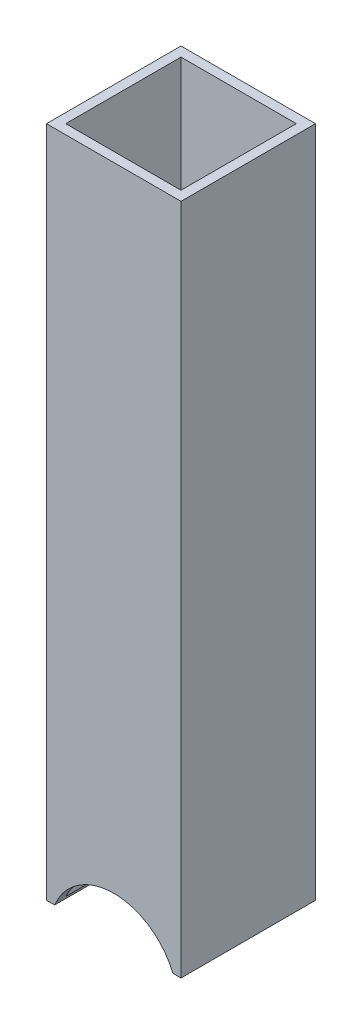
ISO-10303-21;
HEADER;
FILE_DESCRIPTION(('STEP AP214'),'2;1');
FILE_NAME('part.step','',(''),(''),'','','');
FILE_SCHEMA(('AUTOMOTIVE_DESIGN { 1 0 10303 214 1 1 1 1 }'));
ENDSEC;
DATA;
#1=APPLICATION_CONTEXT('core data for automotive mechanical design processes');
#2=APPLICATION_PROTOCOL_DEFINITION('international standard','automotive_design',2000,#1);
#3=PRODUCT_CONTEXT('',#1,'mechanical');
#4=PRODUCT('Part','Part','',(#3));
#5=PRODUCT_RELATED_PRODUCT_CATEGORY('part','',(#4));
#6=PRODUCT_DEFINITION_FORMATION('','',#4);
#7=PRODUCT_DEFINITION_CONTEXT('part definition',#1,'design');
#8=PRODUCT_DEFINITION('design','',#6,#7);
#9=PRODUCT_DEFINITION_SHAPE('','',#8);
#10=(LENGTH_UNIT() NAMED_UNIT(*) SI_UNIT(.MILLI.,.METRE.));
#11=(NAMED_UNIT(*) PLANE_ANGLE_UNIT() SI_UNIT($,.RADIAN.));
#12=(NAMED_UNIT(*) SI_UNIT($,.STERADIAN.) SOLID_ANGLE_UNIT());
#13=UNCERTAINTY_MEASURE_WITH_UNIT(LENGTH_MEASURE(1.E-05),#10,'distance_accuracy_value','');
#14=(GEOMETRIC_REPRESENTATION_CONTEXT(3) GLOBAL_UNCERTAINTY_ASSIGNED_CONTEXT((#13)) GLOBAL_UNIT_ASSIGNED_CONTEXT((#10,
#11,#12)) REPRESENTATION_CONTEXT('',''));
#15=CARTESIAN_POINT('',(0.,0.,0.));
#16=DIRECTION('',(0.,0.,1.));
#17=DIRECTION('',(1.,0.,0.));
#18=AXIS2_PLACEMENT_3D('',#15,#16,#17);
#19=CARTESIAN_POINT('',(0.,-127.,1.33226762955019E-12));
#20=DIRECTION('',(0.,-1.,0.));
#21=DIRECTION('',(0.,0.,-1.));
#22=AXIS2_PLACEMENT_3D('',#19,#20,#21);
#23=PLANE('',#22);
#24=DIRECTION('',(0.,0.,1.));
#25=VECTOR('',#24,1.);
#26=CARTESIAN_POINT('',(19.5306635255947,-127.,-22.2249999999973));
#27=LINE('',#26,#25);
#28=CARTESIAN_POINT('',(19.5306635255947,-127.,-22.2249999999973));
#29=VERTEX_POINT('',#28);
#30=CARTESIAN_POINT('',(19.5306635255948,-127.,22.2250000000013));
#31=VERTEX_POINT('',#30);
#32=EDGE_CURVE('E11',#29,#31,#27,.T.);
#33=ORIENTED_EDGE('',*,*,#32,.F.);
#34=DIRECTION('',(0.999999999999995,0.,0.));
#35=VECTOR('',#34,1.);
#36=CARTESIAN_POINT('',(-22.2249999999998,-127.,-22.2249999999973));
#37=LINE('',#36,#35);
#38=CARTESIAN_POINT('',(22.2249999999998,-127.,-22.2249999999973));
#39=VERTEX_POINT('',#38);
#40=EDGE_CURVE('E211',#29,#39,#37,.T.);
#41=ORIENTED_EDGE('',*,*,#40,.T.);
#42=DIRECTION('',(0.,0.,1.));
#43=VECTOR('',#42,1.);
#44=CARTESIAN_POINT('',(22.2249999999998,-127.,-22.2249999999973));
#45=LINE('',#44,#43);
#46=CARTESIAN_POINT('',(22.225,-127.,22.2250000000013));
#47=VERTEX_POINT('',#46);
#48=EDGE_CURVE('E135',#39,#47,#45,.T.);
#49=ORIENTED_EDGE('',*,*,#48,.T.);
#50=DIRECTION('',(-0.999999999999995,0.,0.));
#51=VECTOR('',#50,1.);
#52=CARTESIAN_POINT('',(22.225,-127.,22.2250000000013));
#53=LINE('',#52,#51);
#54=EDGE_CURVE('E128',#47,#31,#53,.T.);
#55=ORIENTED_EDGE('',*,*,#54,.T.);
#56=EDGE_LOOP('',(#33,#41,#49,#55));
#57=FACE_BOUND('',#56,.T.);
#58=ADVANCED_FACE('F43',(#57),#23,.T.);
#59=CARTESIAN_POINT('',(22.225,-95.25,22.2250000000013));
#60=DIRECTION('',(0.999999999999995,0.,0.));
#61=DIRECTION('',(0.,0.,-1.));
#62=AXIS2_PLACEMENT_3D('',#59,#60,#61);
#63=PLANE('',#62);
#64=DIRECTION('',(0.,1.,0.));
#65=VECTOR('',#64,1.);
#66=CARTESIAN_POINT('',(22.2249999999998,-95.25,-22.225));
#67=LINE('',#66,#65);
#68=CARTESIAN_POINT('',(22.2249999999998,95.2499999999987,-22.225));
#69=VERTEX_POINT('',#68);
#70=EDGE_CURVE('E183',#39,#69,#67,.T.);
#71=ORIENTED_EDGE('',*,*,#70,.T.);
#72=DIRECTION('',(0.,0.,-1.));
#73=VECTOR('',#72,1.);
#74=CARTESIAN_POINT('',(22.225,95.25,22.225));
#75=LINE('',#74,#73);
#76=CARTESIAN_POINT('',(22.225,95.25,22.225));
#77=VERTEX_POINT('',#76);
#78=EDGE_CURVE('E163',#77,#69,#75,.T.);
#79=ORIENTED_EDGE('',*,*,#78,.F.);
#80=DIRECTION('',(0.,1.,0.));
#81=VECTOR('',#80,1.);
#82=CARTESIAN_POINT('',(22.225,-95.25,22.2250000000013));
#83=LINE('',#82,#81);
#84=EDGE_CURVE('E192',#47,#77,#83,.T.);
#85=ORIENTED_EDGE('',*,*,#84,.F.);
#86=ORIENTED_EDGE('',*,*,#48,.F.);
#87=EDGE_LOOP('',(#71,#79,#85,#86));
#88=FACE_BOUND('',#87,.T.);
#89=ADVANCED_FACE('F45',(#88),#63,.T.);
#90=CARTESIAN_POINT('',(-22.2249999999997,-95.25,22.2250000000013));
#91=DIRECTION('',(0.,0.,1.));
#92=DIRECTION('',(0.999999999999995,0.,0.));
#93=AXIS2_PLACEMENT_3D('',#90,#91,#92);
#94=PLANE('',#93);
#95=CARTESIAN_POINT('',(0.,-134.9375,22.2250000000013));
#96=DIRECTION('',(0.,0.,1.));
#97=DIRECTION('',(0.999999999999995,0.,0.));
#98=AXIS2_PLACEMENT_3D('',#95,#96,#97);
#99=CIRCLE('',#98,21.082);
#100=CARTESIAN_POINT('',(-19.5306635255945,-127.,22.2250000000013));
#101=VERTEX_POINT('',#100);
#102=EDGE_CURVE('E66',#31,#101,#99,.T.);
#103=ORIENTED_EDGE('',*,*,#102,.F.);
#104=ORIENTED_EDGE('',*,*,#54,.F.);
#105=ORIENTED_EDGE('',*,*,#84,.T.);
#106=DIRECTION('',(0.999999999999995,0.,0.));
#107=VECTOR('',#106,1.);
#108=CARTESIAN_POINT('',(-22.2249999999997,95.25,22.225));
#109=LINE('',#108,#107);
#110=CARTESIAN_POINT('',(-22.2249999999997,95.25,22.225));
#111=VERTEX_POINT('',#110);
#112=EDGE_CURVE('E175',#111,#77,#109,.T.);
#113=ORIENTED_EDGE('',*,*,#112,.F.);
#114=DIRECTION('',(0.,1.,0.));
#115=VECTOR('',#114,1.);
#116=CARTESIAN_POINT('',(-22.2249999999997,-95.25,22.2250000000013));
#117=LINE('',#116,#115);
#118=CARTESIAN_POINT('',(-22.2249999999997,-127.,22.2250000000013));
#119=VERTEX_POINT('',#118);
#120=EDGE_CURVE('E195',#119,#111,#117,.T.);
#121=ORIENTED_EDGE('',*,*,#120,.F.);
#122=EDGE_CURVE('E130',#101,#119,#53,.T.);
#123=ORIENTED_EDGE('',*,*,#122,.F.);
#124=EDGE_LOOP('',(#103,#104,#105,#113,#121,#123));
#125=FACE_BOUND('',#124,.T.);
#126=ADVANCED_FACE('F127',(#125),#94,.T.);
#127=CARTESIAN_POINT('',(-22.2249999999997,-95.25,22.2250000000013));
#128=DIRECTION('',(-0.999999999999995,0.,0.));
#129=DIRECTION('',(0.,0.,1.));
#130=AXIS2_PLACEMENT_3D('',#127,#128,#129);
#131=PLANE('',#130);
#132=ORIENTED_EDGE('',*,*,#120,.T.);
#133=DIRECTION('',(0.,0.,1.));
#134=VECTOR('',#133,1.);
#135=CARTESIAN_POINT('',(-22.2249999999997,95.25,22.225));
#136=LINE('',#135,#134);
#137=CARTESIAN_POINT('',(-22.2249999999998,95.2499999999987,-22.225));
#138=VERTEX_POINT('',#137);
#139=EDGE_CURVE('E171',#138,#111,#136,.T.);
#140=ORIENTED_EDGE('',*,*,#139,.F.);
#141=DIRECTION('',(0.,1.,0.));
#142=VECTOR('',#141,1.);
#143=CARTESIAN_POINT('',(-22.2249999999998,-95.25,-22.225));
#144=LINE('',#143,#142);
#145=CARTESIAN_POINT('',(-22.2249999999998,-127.,-22.2249999999973));
#146=VERTEX_POINT('',#145);
#147=EDGE_CURVE('E198',#146,#138,#144,.T.);
#148=ORIENTED_EDGE('',*,*,#147,.F.);
#149=DIRECTION('',(0.,0.,-1.));
#150=VECTOR('',#149,1.);
#151=CARTESIAN_POINT('',(-22.2249999999997,-127.,22.2250000000013));
#152=LINE('',#151,#150);
#153=EDGE_CURVE('E137',#119,#146,#152,.T.);
#154=ORIENTED_EDGE('',*,*,#153,.F.);
#155=EDGE_LOOP('',(#132,#140,#148,#154));
#156=FACE_BOUND('',#155,.T.);
#157=ADVANCED_FACE('F283',(#156),#131,.T.);
#158=CARTESIAN_POINT('',(-22.2249999999998,-95.25,-22.225));
#159=DIRECTION('',(0.,0.,-1.));
#160=DIRECTION('',(-0.999999999999995,0.,0.));
#161=AXIS2_PLACEMENT_3D('',#158,#159,#160);
#162=PLANE('',#161);
#163=CARTESIAN_POINT('',(0.,-134.9375,-22.2249999999973));
#164=DIRECTION('',(0.,0.,1.));
#165=DIRECTION('',(0.999999999999995,0.,0.));
#166=AXIS2_PLACEMENT_3D('',#163,#164,#165);
#167=CIRCLE('',#166,21.082);
#168=CARTESIAN_POINT('',(-19.5306635255947,-127.,-22.2249999999973));
#169=VERTEX_POINT('',#168);
#170=EDGE_CURVE('E120',#29,#169,#167,.T.);
#171=ORIENTED_EDGE('',*,*,#170,.T.);
#172=EDGE_CURVE('E209',#146,#169,#37,.T.);
#173=ORIENTED_EDGE('',*,*,#172,.F.);
#174=ORIENTED_EDGE('',*,*,#147,.T.);
#175=DIRECTION('',(-0.999999999999995,0.,0.));
#176=VECTOR('',#175,1.);
#177=CARTESIAN_POINT('',(-22.2249999999998,95.2499999999987,-22.225));
#178=LINE('',#177,#176);
#179=EDGE_CURVE('E167',#69,#138,#178,.T.);
#180=ORIENTED_EDGE('',*,*,#179,.F.);
#181=ORIENTED_EDGE('',*,*,#70,.F.);
#182=ORIENTED_EDGE('',*,*,#40,.F.);
#183=EDGE_LOOP('',(#171,#173,#174,#180,#181,#182));
#184=FACE_BOUND('',#183,.T.);
#185=ADVANCED_FACE('F208',(#184),#162,.T.);
#186=CARTESIAN_POINT('',(19.05,-95.25,19.0500000000013));
#187=DIRECTION('',(0.999999999999995,0.,0.));
#188=DIRECTION('',(0.,0.,-1.));
#189=AXIS2_PLACEMENT_3D('',#186,#187,#188);
#190=PLANE('',#189);
#191=DIRECTION('',(0.,1.,0.));
#192=VECTOR('',#191,1.);
#193=CARTESIAN_POINT('',(19.0499999999998,-95.25,-19.0500000000001));
#194=LINE('',#193,#192);
#195=CARTESIAN_POINT('',(19.0499999999998,-125.907094472007,-19.0499999999974));
#196=VERTEX_POINT('',#195);
#197=CARTESIAN_POINT('',(19.0499999999998,95.2499999999987,-19.05));
#198=VERTEX_POINT('',#197);
#199=EDGE_CURVE('E179',#196,#198,#194,.T.);
#200=ORIENTED_EDGE('',*,*,#199,.F.);
#201=DIRECTION('',(0.,0.,1.));
#202=VECTOR('',#201,1.);
#203=CARTESIAN_POINT('',(19.0499999999998,-125.907094472007,-22.2249999999973));
#204=LINE('',#203,#202);
#205=CARTESIAN_POINT('',(19.05,-125.907094472007,19.0500000000013));
#206=VERTEX_POINT('',#205);
#207=EDGE_CURVE('E59',#196,#206,#204,.T.);
#208=ORIENTED_EDGE('',*,*,#207,.T.);
#209=DIRECTION('',(0.,1.,0.));
#210=VECTOR('',#209,1.);
#211=CARTESIAN_POINT('',(19.05,-95.25,19.0500000000013));
#212=LINE('',#211,#210);
#213=CARTESIAN_POINT('',(19.05,95.25,19.05));
#214=VERTEX_POINT('',#213);
#215=EDGE_CURVE('E180',#206,#214,#212,.T.);
#216=ORIENTED_EDGE('',*,*,#215,.T.);
#217=DIRECTION('',(0.,0.,-1.));
#218=VECTOR('',#217,1.);
#219=CARTESIAN_POINT('',(19.05,95.25,19.05));
#220=LINE('',#219,#218);
#221=EDGE_CURVE('E143',#214,#198,#220,.T.);
#222=ORIENTED_EDGE('',*,*,#221,.T.);
#223=EDGE_LOOP('',(#200,#208,#216,#222));
#224=FACE_BOUND('',#223,.T.);
#225=ADVANCED_FACE('F239',(#224),#190,.F.);
#226=CARTESIAN_POINT('',(-19.0499999999997,-95.25,19.0500000000013));
#227=DIRECTION('',(0.,0.,1.));
#228=DIRECTION('',(0.999999999999995,0.,0.));
#229=AXIS2_PLACEMENT_3D('',#226,#227,#228);
#230=PLANE('',#229);
#231=ORIENTED_EDGE('',*,*,#215,.F.);
#232=CARTESIAN_POINT('',(0.,-134.9375,19.0500000000013));
#233=DIRECTION('',(0.,0.,1.));
#234=DIRECTION('',(0.999999999999995,0.,0.));
#235=AXIS2_PLACEMENT_3D('',#232,#233,#234);
#236=CIRCLE('',#235,21.082);
#237=CARTESIAN_POINT('',(-19.0499999999997,-125.907094472007,19.0500000000013));
#238=VERTEX_POINT('',#237);
#239=EDGE_CURVE('E224',#206,#238,#236,.T.);
#240=ORIENTED_EDGE('',*,*,#239,.T.);
#241=DIRECTION('',(0.,1.,0.));
#242=VECTOR('',#241,1.);
#243=CARTESIAN_POINT('',(-19.0499999999997,-95.25,19.0500000000013));
#244=LINE('',#243,#242);
#245=CARTESIAN_POINT('',(-19.0499999999997,95.25,19.05));
#246=VERTEX_POINT('',#245);
#247=EDGE_CURVE('E184',#238,#246,#244,.T.);
#248=ORIENTED_EDGE('',*,*,#247,.T.);
#249=DIRECTION('',(0.999999999999995,0.,0.));
#250=VECTOR('',#249,1.);
#251=CARTESIAN_POINT('',(-19.0499999999997,95.25,19.05));
#252=LINE('',#251,#250);
#253=EDGE_CURVE('E159',#246,#214,#252,.T.);
#254=ORIENTED_EDGE('',*,*,#253,.T.);
#255=EDGE_LOOP('',(#231,#240,#248,#254));
#256=FACE_BOUND('',#255,.T.);
#257=ADVANCED_FACE('F251',(#256),#230,.F.);
#258=CARTESIAN_POINT('',(-19.0499999999997,-95.25,19.0500000000013));
#259=DIRECTION('',(-0.999999999999995,0.,0.));
#260=DIRECTION('',(0.,0.,1.));
#261=AXIS2_PLACEMENT_3D('',#258,#259,#260);
#262=PLANE('',#261);
#263=ORIENTED_EDGE('',*,*,#247,.F.);
#264=DIRECTION('',(0.,0.,1.));
#265=VECTOR('',#264,1.);
#266=CARTESIAN_POINT('',(-19.0499999999998,-125.907094472007,-22.2249999999973));
#267=LINE('',#266,#265);
#268=CARTESIAN_POINT('',(-19.0499999999998,-125.907094472007,-19.0499999999974));
#269=VERTEX_POINT('',#268);
#270=EDGE_CURVE('E228',#238,#269,#267,.F.);
#271=ORIENTED_EDGE('',*,*,#270,.T.);
#272=DIRECTION('',(0.,1.,0.));
#273=VECTOR('',#272,1.);
#274=CARTESIAN_POINT('',(-19.0499999999998,-95.25,-19.0500000000001));
#275=LINE('',#274,#273);
#276=CARTESIAN_POINT('',(-19.0499999999998,95.2499999999987,-19.05));
#277=VERTEX_POINT('',#276);
#278=EDGE_CURVE('E187',#269,#277,#275,.T.);
#279=ORIENTED_EDGE('',*,*,#278,.T.);
#280=DIRECTION('',(0.,0.,1.));
#281=VECTOR('',#280,1.);
#282=CARTESIAN_POINT('',(-19.0499999999997,95.25,19.05));
#283=LINE('',#282,#281);
#284=EDGE_CURVE('E155',#277,#246,#283,.T.);
#285=ORIENTED_EDGE('',*,*,#284,.T.);
#286=EDGE_LOOP('',(#263,#271,#279,#285));
#287=FACE_BOUND('',#286,.T.);
#288=ADVANCED_FACE('F249',(#287),#262,.F.);
#289=CARTESIAN_POINT('',(-19.0499999999998,-95.25,-19.0500000000001));
#290=DIRECTION('',(0.,0.,-1.));
#291=DIRECTION('',(-0.999999999999995,0.,0.));
#292=AXIS2_PLACEMENT_3D('',#289,#290,#291);
#293=PLANE('',#292);
#294=ORIENTED_EDGE('',*,*,#278,.F.);
#295=CARTESIAN_POINT('',(0.,-134.9375,-19.0499999999974));
#296=DIRECTION('',(0.,0.,-1.));
#297=DIRECTION('',(-0.999999999999995,0.,0.));
#298=AXIS2_PLACEMENT_3D('',#295,#296,#297);
#299=CIRCLE('',#298,21.082);
#300=EDGE_CURVE('E213',#269,#196,#299,.T.);
#301=ORIENTED_EDGE('',*,*,#300,.T.);
#302=ORIENTED_EDGE('',*,*,#199,.T.);
#303=DIRECTION('',(-0.999999999999995,0.,0.));
#304=VECTOR('',#303,1.);
#305=CARTESIAN_POINT('',(-19.0499999999998,95.2499999999987,-19.05));
#306=LINE('',#305,#304);
#307=EDGE_CURVE('E151',#198,#277,#306,.T.);
#308=ORIENTED_EDGE('',*,*,#307,.T.);
#309=EDGE_LOOP('',(#294,#301,#302,#308));
#310=FACE_BOUND('',#309,.T.);
#311=ADVANCED_FACE('F237',(#310),#293,.F.);
#312=CARTESIAN_POINT('',(0.,95.25,0.));
#313=DIRECTION('',(0.,-1.,0.));
#314=DIRECTION('',(0.,0.,-1.));
#315=AXIS2_PLACEMENT_3D('',#312,#313,#314);
#316=PLANE('',#315);
#317=ORIENTED_EDGE('',*,*,#78,.T.);
#318=ORIENTED_EDGE('',*,*,#179,.T.);
#319=ORIENTED_EDGE('',*,*,#139,.T.);
#320=ORIENTED_EDGE('',*,*,#112,.T.);
#321=EDGE_LOOP('',(#317,#318,#319,#320));
#322=FACE_BOUND('',#321,.T.);
#323=ORIENTED_EDGE('',*,*,#221,.F.);
#324=ORIENTED_EDGE('',*,*,#253,.F.);
#325=ORIENTED_EDGE('',*,*,#284,.F.);
#326=ORIENTED_EDGE('',*,*,#307,.F.);
#327=EDGE_LOOP('',(#323,#324,#325,#326));
#328=FACE_BOUND('',#327,.T.);
#329=ADVANCED_FACE('F246',(#322,#328),#316,.F.);
#330=DIRECTION('',(0.,0.,1.));
#331=VECTOR('',#330,1.);
#332=CARTESIAN_POINT('',(-19.5306635255947,-127.,-22.2249999999973));
#333=LINE('',#332,#331);
#334=EDGE_CURVE('E52',#101,#169,#333,.F.);
#335=ORIENTED_EDGE('',*,*,#334,.F.);
#336=ORIENTED_EDGE('',*,*,#122,.T.);
#337=ORIENTED_EDGE('',*,*,#153,.T.);
#338=ORIENTED_EDGE('',*,*,#172,.T.);
#339=EDGE_LOOP('',(#335,#336,#337,#338));
#340=FACE_BOUND('',#339,.T.);
#341=ADVANCED_FACE('F215',(#340),#23,.T.);
#342=CARTESIAN_POINT('',(0.,-134.9375,-22.2249999999973));
#343=DIRECTION('',(0.,0.,1.));
#344=DIRECTION('',(0.999999999999995,0.,0.));
#345=AXIS2_PLACEMENT_3D('',#342,#343,#344);
#346=CYLINDRICAL_SURFACE('',#345,21.082);
#347=ORIENTED_EDGE('',*,*,#32,.T.);
#348=ORIENTED_EDGE('',*,*,#102,.T.);
#349=ORIENTED_EDGE('',*,*,#334,.T.);
#350=ORIENTED_EDGE('',*,*,#170,.F.);
#351=EDGE_LOOP('',(#347,#348,#349,#350));
#352=FACE_BOUND('',#351,.T.);
#353=ORIENTED_EDGE('',*,*,#300,.F.);
#354=ORIENTED_EDGE('',*,*,#270,.F.);
#355=ORIENTED_EDGE('',*,*,#239,.F.);
#356=ORIENTED_EDGE('',*,*,#207,.F.);
#357=EDGE_LOOP('',(#353,#354,#355,#356));
#358=FACE_BOUND('',#357,.T.);
#359=ADVANCED_FACE('F118',(#352,#358),#346,.F.);
#360=CLOSED_SHELL('',(#58,#89,#126,#157,#185,#225,#257,#288,#311,#329,#341,#359));
#361=MANIFOLD_SOLID_BREP('B2',#360);
#362=ADVANCED_BREP_SHAPE_REPRESENTATION('',(#18,#361),#14);
#363=SHAPE_DEFINITION_REPRESENTATION(#9,#362);
ENDSEC;
END-ISO-10303-21;
